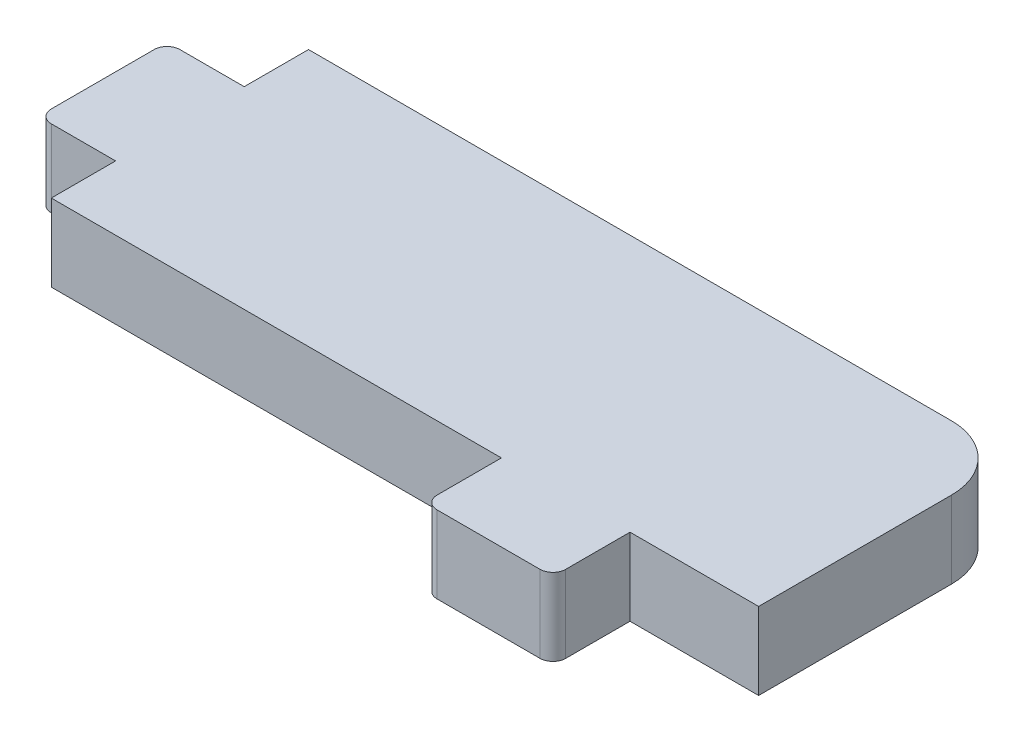
ISO-10303-21;
HEADER;
FILE_DESCRIPTION(('STEP AP214'),'2;1');
FILE_NAME('part.step','',(''),(''),'','','');
FILE_SCHEMA(('AUTOMOTIVE_DESIGN { 1 0 10303 214 1 1 1 1 }'));
ENDSEC;
DATA;
#1=APPLICATION_CONTEXT('core data for automotive mechanical design processes');
#2=APPLICATION_PROTOCOL_DEFINITION('international standard','automotive_design',2000,#1);
#3=PRODUCT_CONTEXT('',#1,'mechanical');
#4=PRODUCT('Part','Part','',(#3));
#5=PRODUCT_RELATED_PRODUCT_CATEGORY('part','',(#4));
#6=PRODUCT_DEFINITION_FORMATION('','',#4);
#7=PRODUCT_DEFINITION_CONTEXT('part definition',#1,'design');
#8=PRODUCT_DEFINITION('design','',#6,#7);
#9=PRODUCT_DEFINITION_SHAPE('','',#8);
#10=(LENGTH_UNIT() NAMED_UNIT(*) SI_UNIT(.MILLI.,.METRE.));
#11=(NAMED_UNIT(*) PLANE_ANGLE_UNIT() SI_UNIT($,.RADIAN.));
#12=(NAMED_UNIT(*) SI_UNIT($,.STERADIAN.) SOLID_ANGLE_UNIT());
#13=UNCERTAINTY_MEASURE_WITH_UNIT(LENGTH_MEASURE(1.E-05),#10,'distance_accuracy_value','');
#14=(GEOMETRIC_REPRESENTATION_CONTEXT(3) GLOBAL_UNCERTAINTY_ASSIGNED_CONTEXT((#13)) GLOBAL_UNIT_ASSIGNED_CONTEXT((#10,
#11,#12)) REPRESENTATION_CONTEXT('',''));
#15=CARTESIAN_POINT('',(0.,0.,0.));
#16=DIRECTION('',(0.,0.,1.));
#17=DIRECTION('',(1.,0.,0.));
#18=AXIS2_PLACEMENT_3D('',#15,#16,#17);
#19=CARTESIAN_POINT('',(-27.5,6.,-9.99999999999999));
#20=DIRECTION('',(1.,0.,0.));
#21=DIRECTION('',(0.,0.,-1.));
#22=AXIS2_PLACEMENT_3D('',#19,#20,#21);
#23=PLANE('',#22);
#24=DIRECTION('',(0.,1.,0.));
#25=VECTOR('',#24,1.);
#26=CARTESIAN_POINT('',(-27.5,6.,5.00000000000002));
#27=LINE('',#26,#25);
#28=CARTESIAN_POINT('',(-27.5,0.,5.00000000000002));
#29=VERTEX_POINT('',#28);
#30=CARTESIAN_POINT('',(-27.5,6.,5.00000000000002));
#31=VERTEX_POINT('',#30);
#32=EDGE_CURVE('E178',#29,#31,#27,.T.);
#33=ORIENTED_EDGE('',*,*,#32,.F.);
#34=DIRECTION('',(0.,0.,1.));
#35=VECTOR('',#34,1.);
#36=CARTESIAN_POINT('',(-27.5,0.,-9.99999999999999));
#37=LINE('',#36,#35);
#38=CARTESIAN_POINT('',(-27.5,0.,10.));
#39=VERTEX_POINT('',#38);
#40=EDGE_CURVE('E173',#29,#39,#37,.T.);
#41=ORIENTED_EDGE('',*,*,#40,.T.);
#42=DIRECTION('',(0.,-1.,0.));
#43=VECTOR('',#42,1.);
#44=CARTESIAN_POINT('',(-27.5,6.,10.));
#45=LINE('',#44,#43);
#46=CARTESIAN_POINT('',(-27.5,6.,10.));
#47=VERTEX_POINT('',#46);
#48=EDGE_CURVE('E269',#47,#39,#45,.T.);
#49=ORIENTED_EDGE('',*,*,#48,.F.);
#50=DIRECTION('',(0.,0.,1.));
#51=VECTOR('',#50,1.);
#52=CARTESIAN_POINT('',(-27.5,6.,-9.99999999999999));
#53=LINE('',#52,#51);
#54=EDGE_CURVE('E188',#31,#47,#53,.T.);
#55=ORIENTED_EDGE('',*,*,#54,.F.);
#56=EDGE_LOOP('',(#33,#41,#49,#55));
#57=FACE_BOUND('',#56,.T.);
#58=ADVANCED_FACE('F33',(#57),#23,.F.);
#59=DIRECTION('',(0.,-1.,0.));
#60=VECTOR('',#59,1.);
#61=CARTESIAN_POINT('',(-27.5,6.,-4.99999999999998));
#62=LINE('',#61,#60);
#63=CARTESIAN_POINT('',(-27.5,6.,-4.99999999999998));
#64=VERTEX_POINT('',#63);
#65=CARTESIAN_POINT('',(-27.5,0.,-4.99999999999998));
#66=VERTEX_POINT('',#65);
#67=EDGE_CURVE('E168',#64,#66,#62,.T.);
#68=ORIENTED_EDGE('',*,*,#67,.F.);
#69=CARTESIAN_POINT('',(-27.5,6.,-9.99999999999999));
#70=VERTEX_POINT('',#69);
#71=EDGE_CURVE('E282',#70,#64,#53,.T.);
#72=ORIENTED_EDGE('',*,*,#71,.F.);
#73=DIRECTION('',(0.,-1.,0.));
#74=VECTOR('',#73,1.);
#75=CARTESIAN_POINT('',(-27.5,6.,-9.99999999999999));
#76=LINE('',#75,#74);
#77=CARTESIAN_POINT('',(-27.5,0.,-9.99999999999999));
#78=VERTEX_POINT('',#77);
#79=EDGE_CURVE('E171',#70,#78,#76,.T.);
#80=ORIENTED_EDGE('',*,*,#79,.T.);
#81=EDGE_CURVE('E154',#78,#66,#37,.T.);
#82=ORIENTED_EDGE('',*,*,#81,.T.);
#83=EDGE_LOOP('',(#68,#72,#80,#82));
#84=FACE_BOUND('',#83,.T.);
#85=ADVANCED_FACE('F166',(#84),#23,.F.);
#86=CARTESIAN_POINT('',(-27.5,6.,10.));
#87=DIRECTION('',(0.,0.,-1.));
#88=DIRECTION('',(-1.,0.,0.));
#89=AXIS2_PLACEMENT_3D('',#86,#87,#88);
#90=PLANE('',#89);
#91=DIRECTION('',(0.,-1.,0.));
#92=VECTOR('',#91,1.);
#93=CARTESIAN_POINT('',(7.49999999999979,0.,10.));
#94=LINE('',#93,#92);
#95=CARTESIAN_POINT('',(7.49999999999979,6.,10.));
#96=VERTEX_POINT('',#95);
#97=CARTESIAN_POINT('',(7.49999999999979,0.,10.));
#98=VERTEX_POINT('',#97);
#99=EDGE_CURVE('E211',#96,#98,#94,.T.);
#100=ORIENTED_EDGE('',*,*,#99,.F.);
#101=DIRECTION('',(1.,0.,0.));
#102=VECTOR('',#101,1.);
#103=CARTESIAN_POINT('',(-27.5,6.,10.));
#104=LINE('',#103,#102);
#105=EDGE_CURVE('E276',#47,#96,#104,.T.);
#106=ORIENTED_EDGE('',*,*,#105,.F.);
#107=ORIENTED_EDGE('',*,*,#48,.T.);
#108=DIRECTION('',(1.,0.,0.));
#109=VECTOR('',#108,1.);
#110=CARTESIAN_POINT('',(-27.5,0.,10.));
#111=LINE('',#110,#109);
#112=EDGE_CURVE('E265',#39,#98,#111,.T.);
#113=ORIENTED_EDGE('',*,*,#112,.T.);
#114=EDGE_LOOP('',(#100,#106,#107,#113));
#115=FACE_BOUND('',#114,.T.);
#116=ADVANCED_FACE('F298',(#115),#90,.F.);
#117=DIRECTION('',(0.,1.,0.));
#118=VECTOR('',#117,1.);
#119=CARTESIAN_POINT('',(17.4999999999998,0.,10.));
#120=LINE('',#119,#118);
#121=CARTESIAN_POINT('',(17.4999999999998,0.,10.));
#122=VERTEX_POINT('',#121);
#123=CARTESIAN_POINT('',(17.4999999999998,6.,10.));
#124=VERTEX_POINT('',#123);
#125=EDGE_CURVE('E202',#122,#124,#120,.T.);
#126=ORIENTED_EDGE('',*,*,#125,.F.);
#127=CARTESIAN_POINT('',(27.5,0.,10.));
#128=VERTEX_POINT('',#127);
#129=EDGE_CURVE('E172',#122,#128,#111,.T.);
#130=ORIENTED_EDGE('',*,*,#129,.T.);
#131=DIRECTION('',(0.,-1.,0.));
#132=VECTOR('',#131,1.);
#133=CARTESIAN_POINT('',(27.5,6.,10.));
#134=LINE('',#133,#132);
#135=CARTESIAN_POINT('',(27.5,6.,10.));
#136=VERTEX_POINT('',#135);
#137=EDGE_CURVE('E259',#136,#128,#134,.T.);
#138=ORIENTED_EDGE('',*,*,#137,.F.);
#139=EDGE_CURVE('E279',#124,#136,#104,.T.);
#140=ORIENTED_EDGE('',*,*,#139,.F.);
#141=EDGE_LOOP('',(#126,#130,#138,#140));
#142=FACE_BOUND('',#141,.T.);
#143=ADVANCED_FACE('F327',(#142),#90,.F.);
#144=CARTESIAN_POINT('',(27.5,6.,-9.99999999999999));
#145=DIRECTION('',(-1.,0.,0.));
#146=DIRECTION('',(0.,0.,1.));
#147=AXIS2_PLACEMENT_3D('',#144,#145,#146);
#148=PLANE('',#147);
#149=DIRECTION('',(0.,0.,-1.));
#150=VECTOR('',#149,1.);
#151=CARTESIAN_POINT('',(27.5,0.,-9.99999999999999));
#152=LINE('',#151,#150);
#153=CARTESIAN_POINT('',(27.5,0.,-5.));
#154=VERTEX_POINT('',#153);
#155=EDGE_CURVE('E243',#128,#154,#152,.T.);
#156=ORIENTED_EDGE('',*,*,#155,.T.);
#157=DIRECTION('',(0.,-1.,0.));
#158=VECTOR('',#157,1.);
#159=CARTESIAN_POINT('',(27.5,6.,-5.));
#160=LINE('',#159,#158);
#161=CARTESIAN_POINT('',(27.5,6.,-5.));
#162=VERTEX_POINT('',#161);
#163=EDGE_CURVE('E41',#154,#162,#160,.F.);
#164=ORIENTED_EDGE('',*,*,#163,.T.);
#165=DIRECTION('',(0.,0.,-1.));
#166=VECTOR('',#165,1.);
#167=CARTESIAN_POINT('',(27.5,6.,-9.99999999999999));
#168=LINE('',#167,#166);
#169=EDGE_CURVE('E268',#136,#162,#168,.T.);
#170=ORIENTED_EDGE('',*,*,#169,.F.);
#171=ORIENTED_EDGE('',*,*,#137,.T.);
#172=EDGE_LOOP('',(#156,#164,#170,#171));
#173=FACE_BOUND('',#172,.T.);
#174=ADVANCED_FACE('F393',(#173),#148,.F.);
#175=CARTESIAN_POINT('',(-27.5,6.,-9.99999999999999));
#176=DIRECTION('',(0.,0.,1.));
#177=DIRECTION('',(1.,0.,0.));
#178=AXIS2_PLACEMENT_3D('',#175,#176,#177);
#179=PLANE('',#178);
#180=DIRECTION('',(-1.,0.,0.));
#181=VECTOR('',#180,1.);
#182=CARTESIAN_POINT('',(-27.5,6.,-9.99999999999999));
#183=LINE('',#182,#181);
#184=CARTESIAN_POINT('',(22.5,6.,-9.99999999999999));
#185=VERTEX_POINT('',#184);
#186=EDGE_CURVE('E330',#185,#70,#183,.T.);
#187=ORIENTED_EDGE('',*,*,#186,.F.);
#188=DIRECTION('',(0.,-1.,0.));
#189=VECTOR('',#188,1.);
#190=CARTESIAN_POINT('',(22.5,6.,-9.99999999999999));
#191=LINE('',#190,#189);
#192=CARTESIAN_POINT('',(22.5,0.,-9.99999999999999));
#193=VERTEX_POINT('',#192);
#194=EDGE_CURVE('E333',#185,#193,#191,.T.);
#195=ORIENTED_EDGE('',*,*,#194,.T.);
#196=DIRECTION('',(-1.,0.,0.));
#197=VECTOR('',#196,1.);
#198=CARTESIAN_POINT('',(-27.5,0.,-9.99999999999999));
#199=LINE('',#198,#197);
#200=EDGE_CURVE('E254',#193,#78,#199,.T.);
#201=ORIENTED_EDGE('',*,*,#200,.T.);
#202=ORIENTED_EDGE('',*,*,#79,.F.);
#203=EDGE_LOOP('',(#187,#195,#201,#202));
#204=FACE_BOUND('',#203,.T.);
#205=ADVANCED_FACE('F390',(#204),#179,.F.);
#206=CARTESIAN_POINT('',(0.,6.,0.));
#207=DIRECTION('',(0.,1.,0.));
#208=DIRECTION('',(0.,0.,1.));
#209=AXIS2_PLACEMENT_3D('',#206,#207,#208);
#210=PLANE('',#209);
#211=ORIENTED_EDGE('',*,*,#169,.T.);
#212=CARTESIAN_POINT('',(22.5,6.,-4.99999999999999));
#213=DIRECTION('',(0.,1.,0.));
#214=DIRECTION('',(0.,0.,1.));
#215=AXIS2_PLACEMENT_3D('',#212,#213,#214);
#216=CIRCLE('',#215,5.);
#217=EDGE_CURVE('E11',#162,#185,#216,.T.);
#218=ORIENTED_EDGE('',*,*,#217,.T.);
#219=ORIENTED_EDGE('',*,*,#186,.T.);
#220=ORIENTED_EDGE('',*,*,#71,.T.);
#221=DIRECTION('',(1.,0.,0.));
#222=VECTOR('',#221,1.);
#223=CARTESIAN_POINT('',(-33.5,6.,-4.99999999999998));
#224=LINE('',#223,#222);
#225=CARTESIAN_POINT('',(-32.5,6.,-4.99999999999998));
#226=VERTEX_POINT('',#225);
#227=EDGE_CURVE('E160',#226,#64,#224,.T.);
#228=ORIENTED_EDGE('',*,*,#227,.F.);
#229=CARTESIAN_POINT('',(-32.5,6.,-3.99999999999998));
#230=DIRECTION('',(0.,1.,0.));
#231=DIRECTION('',(0.,0.,1.));
#232=AXIS2_PLACEMENT_3D('',#229,#230,#231);
#233=CIRCLE('',#232,1.);
#234=CARTESIAN_POINT('',(-33.5,6.,-3.99999999999998));
#235=VERTEX_POINT('',#234);
#236=EDGE_CURVE('E337',#226,#235,#233,.T.);
#237=ORIENTED_EDGE('',*,*,#236,.T.);
#238=DIRECTION('',(0.,0.,-1.));
#239=VECTOR('',#238,1.);
#240=CARTESIAN_POINT('',(-33.5,6.,-4.99999999999998));
#241=LINE('',#240,#239);
#242=CARTESIAN_POINT('',(-33.5,6.,4.00000000000002));
#243=VERTEX_POINT('',#242);
#244=EDGE_CURVE('E177',#243,#235,#241,.T.);
#245=ORIENTED_EDGE('',*,*,#244,.F.);
#246=CARTESIAN_POINT('',(-32.5,6.,4.00000000000002));
#247=DIRECTION('',(0.,1.,0.));
#248=DIRECTION('',(0.,0.,1.));
#249=AXIS2_PLACEMENT_3D('',#246,#247,#248);
#250=CIRCLE('',#249,1.);
#251=CARTESIAN_POINT('',(-32.5,6.,5.00000000000002));
#252=VERTEX_POINT('',#251);
#253=EDGE_CURVE('E341',#243,#252,#250,.T.);
#254=ORIENTED_EDGE('',*,*,#253,.T.);
#255=DIRECTION('',(1.,0.,0.));
#256=VECTOR('',#255,1.);
#257=CARTESIAN_POINT('',(-33.5,6.,5.00000000000002));
#258=LINE('',#257,#256);
#259=EDGE_CURVE('E215',#252,#31,#258,.T.);
#260=ORIENTED_EDGE('',*,*,#259,.T.);
#261=ORIENTED_EDGE('',*,*,#54,.T.);
#262=ORIENTED_EDGE('',*,*,#105,.T.);
#263=DIRECTION('',(0.,0.,-1.));
#264=VECTOR('',#263,1.);
#265=CARTESIAN_POINT('',(7.49999999999979,6.,16.));
#266=LINE('',#265,#264);
#267=CARTESIAN_POINT('',(7.49999999999979,6.,15.));
#268=VERTEX_POINT('',#267);
#269=EDGE_CURVE('E205',#268,#96,#266,.T.);
#270=ORIENTED_EDGE('',*,*,#269,.F.);
#271=CARTESIAN_POINT('',(8.49999999999979,6.,15.));
#272=DIRECTION('',(0.,1.,0.));
#273=DIRECTION('',(0.,0.,1.));
#274=AXIS2_PLACEMENT_3D('',#271,#272,#273);
#275=CIRCLE('',#274,1.);
#276=CARTESIAN_POINT('',(8.49999999999979,6.,16.));
#277=VERTEX_POINT('',#276);
#278=EDGE_CURVE('E229',#268,#277,#275,.T.);
#279=ORIENTED_EDGE('',*,*,#278,.T.);
#280=DIRECTION('',(-1.,0.,0.));
#281=VECTOR('',#280,1.);
#282=CARTESIAN_POINT('',(17.4999999999998,6.,16.));
#283=LINE('',#282,#281);
#284=CARTESIAN_POINT('',(16.4999999999998,6.,16.));
#285=VERTEX_POINT('',#284);
#286=EDGE_CURVE('E201',#285,#277,#283,.T.);
#287=ORIENTED_EDGE('',*,*,#286,.F.);
#288=CARTESIAN_POINT('',(16.4999999999998,6.,15.));
#289=DIRECTION('',(0.,1.,0.));
#290=DIRECTION('',(0.,0.,1.));
#291=AXIS2_PLACEMENT_3D('',#288,#289,#290);
#292=CIRCLE('',#291,1.);
#293=CARTESIAN_POINT('',(17.4999999999998,6.,15.));
#294=VERTEX_POINT('',#293);
#295=EDGE_CURVE('E238',#285,#294,#292,.T.);
#296=ORIENTED_EDGE('',*,*,#295,.T.);
#297=DIRECTION('',(0.,0.,-1.));
#298=VECTOR('',#297,1.);
#299=CARTESIAN_POINT('',(17.4999999999998,6.,16.));
#300=LINE('',#299,#298);
#301=EDGE_CURVE('E224',#294,#124,#300,.T.);
#302=ORIENTED_EDGE('',*,*,#301,.T.);
#303=ORIENTED_EDGE('',*,*,#139,.T.);
#304=EDGE_LOOP('',(#211,#218,#219,#220,#228,#237,#245,#254,#260,#261,#262,#270,#279,#287,#296,
#302,#303));
#305=FACE_BOUND('',#304,.T.);
#306=ADVANCED_FACE('F303',(#305),#210,.T.);
#307=CARTESIAN_POINT('',(0.,0.,0.));
#308=DIRECTION('',(0.,1.,0.));
#309=DIRECTION('',(0.,0.,1.));
#310=AXIS2_PLACEMENT_3D('',#307,#308,#309);
#311=PLANE('',#310);
#312=ORIENTED_EDGE('',*,*,#200,.F.);
#313=CARTESIAN_POINT('',(22.5,0.,-4.99999999999999));
#314=DIRECTION('',(0.,1.,0.));
#315=DIRECTION('',(0.,0.,1.));
#316=AXIS2_PLACEMENT_3D('',#313,#314,#315);
#317=CIRCLE('',#316,5.);
#318=EDGE_CURVE('E55',#193,#154,#317,.F.);
#319=ORIENTED_EDGE('',*,*,#318,.T.);
#320=ORIENTED_EDGE('',*,*,#155,.F.);
#321=ORIENTED_EDGE('',*,*,#129,.F.);
#322=DIRECTION('',(0.,0.,-1.));
#323=VECTOR('',#322,1.);
#324=CARTESIAN_POINT('',(17.4999999999998,0.,16.));
#325=LINE('',#324,#323);
#326=CARTESIAN_POINT('',(17.4999999999998,0.,15.));
#327=VERTEX_POINT('',#326);
#328=EDGE_CURVE('E228',#327,#122,#325,.T.);
#329=ORIENTED_EDGE('',*,*,#328,.F.);
#330=CARTESIAN_POINT('',(16.4999999999998,0.,15.));
#331=DIRECTION('',(0.,1.,0.));
#332=DIRECTION('',(0.,0.,1.));
#333=AXIS2_PLACEMENT_3D('',#330,#331,#332);
#334=CIRCLE('',#333,1.);
#335=CARTESIAN_POINT('',(16.4999999999998,0.,16.));
#336=VERTEX_POINT('',#335);
#337=EDGE_CURVE('E245',#327,#336,#334,.F.);
#338=ORIENTED_EDGE('',*,*,#337,.T.);
#339=DIRECTION('',(1.,0.,0.));
#340=VECTOR('',#339,1.);
#341=CARTESIAN_POINT('',(17.4999999999998,0.,16.));
#342=LINE('',#341,#340);
#343=CARTESIAN_POINT('',(8.49999999999979,0.,16.));
#344=VERTEX_POINT('',#343);
#345=EDGE_CURVE('E198',#344,#336,#342,.T.);
#346=ORIENTED_EDGE('',*,*,#345,.F.);
#347=CARTESIAN_POINT('',(8.49999999999979,0.,15.));
#348=DIRECTION('',(0.,1.,0.));
#349=DIRECTION('',(0.,0.,1.));
#350=AXIS2_PLACEMENT_3D('',#347,#348,#349);
#351=CIRCLE('',#350,1.);
#352=CARTESIAN_POINT('',(7.49999999999979,0.,15.));
#353=VERTEX_POINT('',#352);
#354=EDGE_CURVE('E241',#344,#353,#351,.F.);
#355=ORIENTED_EDGE('',*,*,#354,.T.);
#356=DIRECTION('',(0.,0.,-1.));
#357=VECTOR('',#356,1.);
#358=CARTESIAN_POINT('',(7.49999999999979,0.,16.));
#359=LINE('',#358,#357);
#360=EDGE_CURVE('E237',#353,#98,#359,.T.);
#361=ORIENTED_EDGE('',*,*,#360,.T.);
#362=ORIENTED_EDGE('',*,*,#112,.F.);
#363=ORIENTED_EDGE('',*,*,#40,.F.);
#364=DIRECTION('',(1.,0.,0.));
#365=VECTOR('',#364,1.);
#366=CARTESIAN_POINT('',(-33.5,0.,5.00000000000003));
#367=LINE('',#366,#365);
#368=CARTESIAN_POINT('',(-32.5,0.,5.00000000000003));
#369=VERTEX_POINT('',#368);
#370=EDGE_CURVE('E161',#369,#29,#367,.T.);
#371=ORIENTED_EDGE('',*,*,#370,.F.);
#372=CARTESIAN_POINT('',(-32.5,0.,4.00000000000003));
#373=DIRECTION('',(0.,1.,0.));
#374=DIRECTION('',(0.,0.,1.));
#375=AXIS2_PLACEMENT_3D('',#372,#373,#374);
#376=CIRCLE('',#375,1.);
#377=CARTESIAN_POINT('',(-33.5,0.,4.00000000000003));
#378=VERTEX_POINT('',#377);
#379=EDGE_CURVE('E356',#369,#378,#376,.F.);
#380=ORIENTED_EDGE('',*,*,#379,.T.);
#381=DIRECTION('',(0.,0.,1.));
#382=VECTOR('',#381,1.);
#383=CARTESIAN_POINT('',(-33.5,0.,-4.99999999999997));
#384=LINE('',#383,#382);
#385=CARTESIAN_POINT('',(-33.5,0.,-3.99999999999997));
#386=VERTEX_POINT('',#385);
#387=EDGE_CURVE('E181',#386,#378,#384,.T.);
#388=ORIENTED_EDGE('',*,*,#387,.F.);
#389=CARTESIAN_POINT('',(-32.5,0.,-3.99999999999997));
#390=DIRECTION('',(0.,1.,0.));
#391=DIRECTION('',(0.,0.,1.));
#392=AXIS2_PLACEMENT_3D('',#389,#390,#391);
#393=CIRCLE('',#392,1.);
#394=CARTESIAN_POINT('',(-32.5,0.,-4.99999999999997));
#395=VERTEX_POINT('',#394);
#396=EDGE_CURVE('E156',#386,#395,#393,.F.);
#397=ORIENTED_EDGE('',*,*,#396,.T.);
#398=DIRECTION('',(1.,0.,0.));
#399=VECTOR('',#398,1.);
#400=CARTESIAN_POINT('',(-33.5,0.,-4.99999999999997));
#401=LINE('',#400,#399);
#402=EDGE_CURVE('E151',#395,#66,#401,.T.);
#403=ORIENTED_EDGE('',*,*,#402,.T.);
#404=ORIENTED_EDGE('',*,*,#81,.F.);
#405=EDGE_LOOP('',(#312,#319,#320,#321,#329,#338,#346,#355,#361,#362,#363,#371,#380,#388,#397,
#403,#404));
#406=FACE_BOUND('',#405,.T.);
#407=ADVANCED_FACE('F153',(#406),#311,.F.);
#408=CARTESIAN_POINT('',(7.49999999999979,0.,16.));
#409=DIRECTION('',(1.,0.,0.));
#410=DIRECTION('',(0.,1.,0.));
#411=AXIS2_PLACEMENT_3D('',#408,#409,#410);
#412=PLANE('',#411);
#413=ORIENTED_EDGE('',*,*,#360,.F.);
#414=DIRECTION('',(0.,-1.,0.));
#415=VECTOR('',#414,1.);
#416=CARTESIAN_POINT('',(7.49999999999979,6.,15.));
#417=LINE('',#416,#415);
#418=EDGE_CURVE('E247',#353,#268,#417,.F.);
#419=ORIENTED_EDGE('',*,*,#418,.T.);
#420=ORIENTED_EDGE('',*,*,#269,.T.);
#421=ORIENTED_EDGE('',*,*,#99,.T.);
#422=EDGE_LOOP('',(#413,#419,#420,#421));
#423=FACE_BOUND('',#422,.T.);
#424=ADVANCED_FACE('F300',(#423),#412,.F.);
#425=CARTESIAN_POINT('',(17.4999999999998,0.,16.));
#426=DIRECTION('',(-1.,0.,0.));
#427=DIRECTION('',(0.,-1.,0.));
#428=AXIS2_PLACEMENT_3D('',#425,#426,#427);
#429=PLANE('',#428);
#430=ORIENTED_EDGE('',*,*,#301,.F.);
#431=DIRECTION('',(0.,1.,0.));
#432=VECTOR('',#431,1.);
#433=CARTESIAN_POINT('',(17.4999999999998,0.,15.));
#434=LINE('',#433,#432);
#435=EDGE_CURVE('E239',#294,#327,#434,.F.);
#436=ORIENTED_EDGE('',*,*,#435,.T.);
#437=ORIENTED_EDGE('',*,*,#328,.T.);
#438=ORIENTED_EDGE('',*,*,#125,.T.);
#439=EDGE_LOOP('',(#430,#436,#437,#438));
#440=FACE_BOUND('',#439,.T.);
#441=ADVANCED_FACE('F324',(#440),#429,.F.);
#442=CARTESIAN_POINT('',(0.,0.,16.));
#443=DIRECTION('',(0.,0.,1.));
#444=DIRECTION('',(1.,0.,0.));
#445=AXIS2_PLACEMENT_3D('',#442,#443,#444);
#446=PLANE('',#445);
#447=ORIENTED_EDGE('',*,*,#345,.T.);
#448=DIRECTION('',(0.,1.,0.));
#449=VECTOR('',#448,1.);
#450=CARTESIAN_POINT('',(16.4999999999998,6.,16.));
#451=LINE('',#450,#449);
#452=EDGE_CURVE('E225',#336,#285,#451,.T.);
#453=ORIENTED_EDGE('',*,*,#452,.T.);
#454=ORIENTED_EDGE('',*,*,#286,.T.);
#455=DIRECTION('',(0.,-1.,0.));
#456=VECTOR('',#455,1.);
#457=CARTESIAN_POINT('',(8.49999999999979,0.,16.));
#458=LINE('',#457,#456);
#459=EDGE_CURVE('E220',#277,#344,#458,.T.);
#460=ORIENTED_EDGE('',*,*,#459,.T.);
#461=EDGE_LOOP('',(#447,#453,#454,#460));
#462=FACE_BOUND('',#461,.T.);
#463=ADVANCED_FACE('F313',(#462),#446,.T.);
#464=CARTESIAN_POINT('',(16.4999999999998,0.,15.));
#465=DIRECTION('',(0.,-1.,0.));
#466=DIRECTION('',(1.,0.,0.));
#467=AXIS2_PLACEMENT_3D('',#464,#465,#466);
#468=CYLINDRICAL_SURFACE('',#467,1.);
#469=ORIENTED_EDGE('',*,*,#337,.F.);
#470=ORIENTED_EDGE('',*,*,#435,.F.);
#471=ORIENTED_EDGE('',*,*,#295,.F.);
#472=ORIENTED_EDGE('',*,*,#452,.F.);
#473=EDGE_LOOP('',(#469,#470,#471,#472));
#474=FACE_BOUND('',#473,.T.);
#475=ADVANCED_FACE('F319',(#474),#468,.T.);
#476=CARTESIAN_POINT('',(8.49999999999979,0.,15.));
#477=DIRECTION('',(0.,1.,0.));
#478=DIRECTION('',(-1.,0.,0.));
#479=AXIS2_PLACEMENT_3D('',#476,#477,#478);
#480=CYLINDRICAL_SURFACE('',#479,1.);
#481=ORIENTED_EDGE('',*,*,#278,.F.);
#482=ORIENTED_EDGE('',*,*,#418,.F.);
#483=ORIENTED_EDGE('',*,*,#354,.F.);
#484=ORIENTED_EDGE('',*,*,#459,.F.);
#485=EDGE_LOOP('',(#481,#482,#483,#484));
#486=FACE_BOUND('',#485,.T.);
#487=ADVANCED_FACE('F307',(#486),#480,.T.);
#488=CARTESIAN_POINT('',(-33.5,6.,5.00000000000002));
#489=DIRECTION('',(0.,0.,-1.));
#490=DIRECTION('',(-1.,0.,0.));
#491=AXIS2_PLACEMENT_3D('',#488,#489,#490);
#492=PLANE('',#491);
#493=ORIENTED_EDGE('',*,*,#259,.F.);
#494=DIRECTION('',(0.,1.,0.));
#495=VECTOR('',#494,1.);
#496=CARTESIAN_POINT('',(-32.5,0.,5.00000000000003));
#497=LINE('',#496,#495);
#498=EDGE_CURVE('E334',#252,#369,#497,.F.);
#499=ORIENTED_EDGE('',*,*,#498,.T.);
#500=ORIENTED_EDGE('',*,*,#370,.T.);
#501=ORIENTED_EDGE('',*,*,#32,.T.);
#502=EDGE_LOOP('',(#493,#499,#500,#501));
#503=FACE_BOUND('',#502,.T.);
#504=ADVANCED_FACE('F373',(#503),#492,.F.);
#505=CARTESIAN_POINT('',(-33.5,6.,-4.99999999999998));
#506=DIRECTION('',(0.,0.,1.));
#507=DIRECTION('',(1.,0.,0.));
#508=AXIS2_PLACEMENT_3D('',#505,#506,#507);
#509=PLANE('',#508);
#510=ORIENTED_EDGE('',*,*,#402,.F.);
#511=DIRECTION('',(0.,-1.,0.));
#512=VECTOR('',#511,1.);
#513=CARTESIAN_POINT('',(-32.5,6.,-4.99999999999998));
#514=LINE('',#513,#512);
#515=EDGE_CURVE('E343',#395,#226,#514,.F.);
#516=ORIENTED_EDGE('',*,*,#515,.T.);
#517=ORIENTED_EDGE('',*,*,#227,.T.);
#518=ORIENTED_EDGE('',*,*,#67,.T.);
#519=EDGE_LOOP('',(#510,#516,#517,#518));
#520=FACE_BOUND('',#519,.T.);
#521=ADVANCED_FACE('F175',(#520),#509,.F.);
#522=CARTESIAN_POINT('',(-33.5,0.,0.));
#523=DIRECTION('',(-1.,0.,0.));
#524=DIRECTION('',(0.,-1.,0.));
#525=AXIS2_PLACEMENT_3D('',#522,#523,#524);
#526=PLANE('',#525);
#527=ORIENTED_EDGE('',*,*,#244,.T.);
#528=DIRECTION('',(0.,-1.,0.));
#529=VECTOR('',#528,1.);
#530=CARTESIAN_POINT('',(-33.5,0.,-3.99999999999997));
#531=LINE('',#530,#529);
#532=EDGE_CURVE('E354',#235,#386,#531,.T.);
#533=ORIENTED_EDGE('',*,*,#532,.T.);
#534=ORIENTED_EDGE('',*,*,#387,.T.);
#535=DIRECTION('',(0.,1.,0.));
#536=VECTOR('',#535,1.);
#537=CARTESIAN_POINT('',(-33.5,6.,4.00000000000002));
#538=LINE('',#537,#536);
#539=EDGE_CURVE('E248',#378,#243,#538,.T.);
#540=ORIENTED_EDGE('',*,*,#539,.T.);
#541=EDGE_LOOP('',(#527,#533,#534,#540));
#542=FACE_BOUND('',#541,.T.);
#543=ADVANCED_FACE('F368',(#542),#526,.T.);
#544=CARTESIAN_POINT('',(-32.5,0.,-3.99999999999997));
#545=DIRECTION('',(0.,1.,0.));
#546=DIRECTION('',(-1.,0.,0.));
#547=AXIS2_PLACEMENT_3D('',#544,#545,#546);
#548=CYLINDRICAL_SURFACE('',#547,1.);
#549=ORIENTED_EDGE('',*,*,#236,.F.);
#550=ORIENTED_EDGE('',*,*,#515,.F.);
#551=ORIENTED_EDGE('',*,*,#396,.F.);
#552=ORIENTED_EDGE('',*,*,#532,.F.);
#553=EDGE_LOOP('',(#549,#550,#551,#552));
#554=FACE_BOUND('',#553,.T.);
#555=ADVANCED_FACE('F362',(#554),#548,.T.);
#556=CARTESIAN_POINT('',(-32.5,0.,4.00000000000003));
#557=DIRECTION('',(0.,-1.,0.));
#558=DIRECTION('',(1.,0.,0.));
#559=AXIS2_PLACEMENT_3D('',#556,#557,#558);
#560=CYLINDRICAL_SURFACE('',#559,1.);
#561=ORIENTED_EDGE('',*,*,#379,.F.);
#562=ORIENTED_EDGE('',*,*,#498,.F.);
#563=ORIENTED_EDGE('',*,*,#253,.F.);
#564=ORIENTED_EDGE('',*,*,#539,.F.);
#565=EDGE_LOOP('',(#561,#562,#563,#564));
#566=FACE_BOUND('',#565,.T.);
#567=ADVANCED_FACE('F374',(#566),#560,.T.);
#568=CARTESIAN_POINT('',(22.5,6.,-4.99999999999999));
#569=DIRECTION('',(0.,-1.,0.));
#570=DIRECTION('',(0.,0.,-1.));
#571=AXIS2_PLACEMENT_3D('',#568,#569,#570);
#572=CYLINDRICAL_SURFACE('',#571,5.);
#573=ORIENTED_EDGE('',*,*,#217,.F.);
#574=ORIENTED_EDGE('',*,*,#163,.F.);
#575=ORIENTED_EDGE('',*,*,#318,.F.);
#576=ORIENTED_EDGE('',*,*,#194,.F.);
#577=EDGE_LOOP('',(#573,#574,#575,#576));
#578=FACE_BOUND('',#577,.T.);
#579=ADVANCED_FACE('F35',(#578),#572,.T.);
#580=CLOSED_SHELL('',(#58,#85,#116,#143,#174,#205,#306,#407,#424,#441,#463,#475,#487,#504,#521,
#543,#555,#567,#579));
#581=MANIFOLD_SOLID_BREP('B2',#580);
#582=ADVANCED_BREP_SHAPE_REPRESENTATION('',(#18,#581),#14);
#583=SHAPE_DEFINITION_REPRESENTATION(#9,#582);
ENDSEC;
END-ISO-10303-21;
